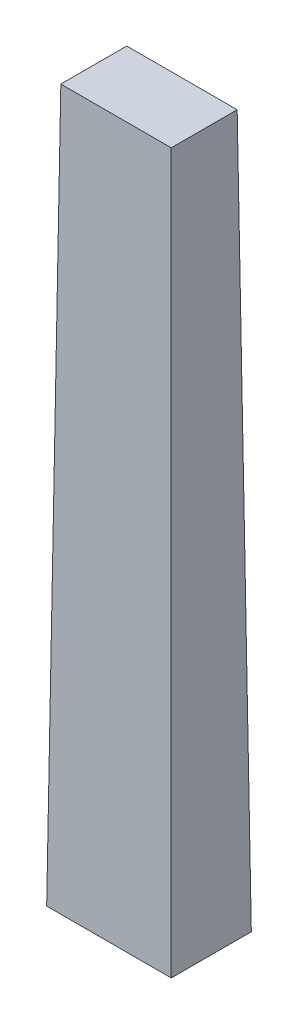
ISO-10303-21;
HEADER;
FILE_DESCRIPTION(('STEP AP214'),'2;1');
FILE_NAME('part.step','',(''),(''),'','','');
FILE_SCHEMA(('AUTOMOTIVE_DESIGN { 1 0 10303 214 1 1 1 1 }'));
ENDSEC;
DATA;
#1=APPLICATION_CONTEXT('core data for automotive mechanical design processes');
#2=APPLICATION_PROTOCOL_DEFINITION('international standard','automotive_design',2000,#1);
#3=PRODUCT_CONTEXT('',#1,'mechanical');
#4=PRODUCT('Part','Part','',(#3));
#5=PRODUCT_RELATED_PRODUCT_CATEGORY('part','',(#4));
#6=PRODUCT_DEFINITION_FORMATION('','',#4);
#7=PRODUCT_DEFINITION_CONTEXT('part definition',#1,'design');
#8=PRODUCT_DEFINITION('design','',#6,#7);
#9=PRODUCT_DEFINITION_SHAPE('','',#8);
#10=(LENGTH_UNIT() NAMED_UNIT(*) SI_UNIT(.MILLI.,.METRE.));
#11=(NAMED_UNIT(*) PLANE_ANGLE_UNIT() SI_UNIT($,.RADIAN.));
#12=(NAMED_UNIT(*) SI_UNIT($,.STERADIAN.) SOLID_ANGLE_UNIT());
#13=UNCERTAINTY_MEASURE_WITH_UNIT(LENGTH_MEASURE(1.E-05),#10,'distance_accuracy_value','');
#14=(GEOMETRIC_REPRESENTATION_CONTEXT(3) GLOBAL_UNCERTAINTY_ASSIGNED_CONTEXT((#13)) GLOBAL_UNIT_ASSIGNED_CONTEXT((#10,
#11,#12)) REPRESENTATION_CONTEXT('',''));
#15=CARTESIAN_POINT('',(0.,0.,0.));
#16=DIRECTION('',(0.,0.,1.));
#17=DIRECTION('',(1.,0.,0.));
#18=AXIS2_PLACEMENT_3D('',#15,#16,#17);
#19=CARTESIAN_POINT('',(-8.096049858686,0.,-9.18392244204399));
#20=DIRECTION('',(-0.999950515308283,0.00994821263837438,0.));
#21=DIRECTION('',(-0.00994821263837438,-0.999950515308283,0.));
#22=AXIS2_PLACEMENT_3D('',#19,#20,#21);
#23=PLANE('',#22);
#24=DIRECTION('',(0.,0.,1.));
#25=VECTOR('',#24,1.);
#26=CARTESIAN_POINT('',(-8.096049858686,0.,-9.18392244204399));
#27=LINE('',#26,#25);
#28=CARTESIAN_POINT('',(-8.096049858686,0.,-9.18392244204399));
#29=VERTEX_POINT('',#28);
#30=CARTESIAN_POINT('',(-8.096049858686,0.,-0.183922442043995));
#31=VERTEX_POINT('',#30);
#32=EDGE_CURVE('E83',#29,#31,#27,.T.);
#33=ORIENTED_EDGE('',*,*,#32,.T.);
#34=DIRECTION('',(-0.00994772040285509,-0.999901037962044,0.00994772040285509));
#35=VECTOR('',#34,1.);
#36=CARTESIAN_POINT('',(-8.096049858686,0.,-0.183922442043995));
#37=LINE('',#36,#35);
#38=CARTESIAN_POINT('',(-7.30015346292827,80.,-0.979818837801727));
#39=VERTEX_POINT('',#38);
#40=EDGE_CURVE('E11',#39,#31,#37,.T.);
#41=ORIENTED_EDGE('',*,*,#40,.F.);
#42=DIRECTION('',(0.,0.,-1.));
#43=VECTOR('',#42,1.);
#44=CARTESIAN_POINT('',(-7.30015346292827,80.,-9.18392244204399));
#45=LINE('',#44,#43);
#46=CARTESIAN_POINT('',(-7.30015346292827,80.,-8.38802604628626));
#47=VERTEX_POINT('',#46);
#48=EDGE_CURVE('E99',#47,#39,#45,.F.);
#49=ORIENTED_EDGE('',*,*,#48,.F.);
#50=DIRECTION('',(-0.00994772040285508,-0.999901037962044,-0.00994772040285509));
#51=VECTOR('',#50,1.);
#52=CARTESIAN_POINT('',(-8.096049858686,0.,-9.18392244204399));
#53=LINE('',#52,#51);
#54=EDGE_CURVE('E94',#47,#29,#53,.T.);
#55=ORIENTED_EDGE('',*,*,#54,.T.);
#56=EDGE_LOOP('',(#33,#41,#49,#55));
#57=FACE_BOUND('',#56,.T.);
#58=ADVANCED_FACE('F37',(#57),#23,.T.);
#59=CARTESIAN_POINT('',(-8.096049858686,0.,-0.183922442043995));
#60=DIRECTION('',(0.,0.00994821263837438,0.999950515308283));
#61=DIRECTION('',(0.,-0.999950515308283,0.00994821263837438));
#62=AXIS2_PLACEMENT_3D('',#59,#60,#61);
#63=PLANE('',#62);
#64=DIRECTION('',(1.,0.,0.));
#65=VECTOR('',#64,1.);
#66=CARTESIAN_POINT('',(-8.096049858686,0.,-0.183922442043995));
#67=LINE('',#66,#65);
#68=CARTESIAN_POINT('',(5.903950141314,0.,-0.183922442043995));
#69=VERTEX_POINT('',#68);
#70=EDGE_CURVE('E79',#31,#69,#67,.T.);
#71=ORIENTED_EDGE('',*,*,#70,.T.);
#72=DIRECTION('',(0.00994772040285509,-0.999901037962044,0.00994772040285509));
#73=VECTOR('',#72,1.);
#74=CARTESIAN_POINT('',(5.90305952704308,0.089520623605539,-0.184813056314915));
#75=LINE('',#74,#73);
#76=CARTESIAN_POINT('',(5.10805374555626,80.,-0.979818837801727));
#77=VERTEX_POINT('',#76);
#78=EDGE_CURVE('E46',#77,#69,#75,.T.);
#79=ORIENTED_EDGE('',*,*,#78,.F.);
#80=DIRECTION('',(-1.,0.,0.));
#81=VECTOR('',#80,1.);
#82=CARTESIAN_POINT('',(-8.096049858686,80.,-0.979818837801727));
#83=LINE('',#82,#81);
#84=EDGE_CURVE('E90',#39,#77,#83,.F.);
#85=ORIENTED_EDGE('',*,*,#84,.F.);
#86=ORIENTED_EDGE('',*,*,#40,.T.);
#87=EDGE_LOOP('',(#71,#79,#85,#86));
#88=FACE_BOUND('',#87,.T.);
#89=ADVANCED_FACE('F39',(#88),#63,.T.);
#90=CARTESIAN_POINT('',(5.903950141314,0.,-9.18392244204399));
#91=DIRECTION('',(0.999950515308283,0.00994821263837438,0.));
#92=DIRECTION('',(-0.00994821263837438,0.999950515308283,0.));
#93=AXIS2_PLACEMENT_3D('',#90,#91,#92);
#94=PLANE('',#93);
#95=DIRECTION('',(0.,0.,-1.));
#96=VECTOR('',#95,1.);
#97=CARTESIAN_POINT('',(5.903950141314,0.,-9.18392244204399));
#98=LINE('',#97,#96);
#99=CARTESIAN_POINT('',(5.903950141314,0.,-9.18392244204399));
#100=VERTEX_POINT('',#99);
#101=EDGE_CURVE('E84',#69,#100,#98,.T.);
#102=ORIENTED_EDGE('',*,*,#101,.T.);
#103=DIRECTION('',(0.00994772040285508,-0.999901037962044,-0.00994772040285509));
#104=VECTOR('',#103,1.);
#105=CARTESIAN_POINT('',(5.90256474133701,0.139254303386394,-9.18253704206701));
#106=LINE('',#105,#104);
#107=CARTESIAN_POINT('',(5.10805374555626,80.,-8.38802604628626));
#108=VERTEX_POINT('',#107);
#109=EDGE_CURVE('E102',#108,#100,#106,.T.);
#110=ORIENTED_EDGE('',*,*,#109,.F.);
#111=DIRECTION('',(0.,0.,1.));
#112=VECTOR('',#111,1.);
#113=CARTESIAN_POINT('',(5.10805374555626,80.,-9.18392244204399));
#114=LINE('',#113,#112);
#115=EDGE_CURVE('E58',#77,#108,#114,.F.);
#116=ORIENTED_EDGE('',*,*,#115,.F.);
#117=ORIENTED_EDGE('',*,*,#78,.T.);
#118=EDGE_LOOP('',(#102,#110,#116,#117));
#119=FACE_BOUND('',#118,.T.);
#120=ADVANCED_FACE('F109',(#119),#94,.T.);
#121=CARTESIAN_POINT('',(-8.096049858686,0.,-9.18392244204399));
#122=DIRECTION('',(0.,0.00994821263837438,-0.999950515308283));
#123=DIRECTION('',(0.,0.999950515308284,0.00994821263837438));
#124=AXIS2_PLACEMENT_3D('',#121,#122,#123);
#125=PLANE('',#124);
#126=DIRECTION('',(-1.,0.,0.));
#127=VECTOR('',#126,1.);
#128=CARTESIAN_POINT('',(-8.096049858686,0.,-9.18392244204399));
#129=LINE('',#128,#127);
#130=EDGE_CURVE('E98',#100,#29,#129,.T.);
#131=ORIENTED_EDGE('',*,*,#130,.T.);
#132=ORIENTED_EDGE('',*,*,#54,.F.);
#133=DIRECTION('',(1.,0.,0.));
#134=VECTOR('',#133,1.);
#135=CARTESIAN_POINT('',(-8.096049858686,80.,-8.38802604628626));
#136=LINE('',#135,#134);
#137=EDGE_CURVE('E41',#108,#47,#136,.F.);
#138=ORIENTED_EDGE('',*,*,#137,.F.);
#139=ORIENTED_EDGE('',*,*,#109,.T.);
#140=EDGE_LOOP('',(#131,#132,#138,#139));
#141=FACE_BOUND('',#140,.T.);
#142=ADVANCED_FACE('F111',(#141),#125,.T.);
#143=CARTESIAN_POINT('',(0.,80.,0.));
#144=DIRECTION('',(0.,1.,0.));
#145=DIRECTION('',(0.,0.,1.));
#146=AXIS2_PLACEMENT_3D('',#143,#144,#145);
#147=PLANE('',#146);
#148=ORIENTED_EDGE('',*,*,#48,.T.);
#149=ORIENTED_EDGE('',*,*,#84,.T.);
#150=ORIENTED_EDGE('',*,*,#115,.T.);
#151=ORIENTED_EDGE('',*,*,#137,.T.);
#152=EDGE_LOOP('',(#148,#149,#150,#151));
#153=FACE_BOUND('',#152,.T.);
#154=ADVANCED_FACE('F107',(#153),#147,.T.);
#155=CARTESIAN_POINT('',(0.,0.,0.));
#156=DIRECTION('',(0.,1.,0.));
#157=DIRECTION('',(0.,0.,1.));
#158=AXIS2_PLACEMENT_3D('',#155,#156,#157);
#159=PLANE('',#158);
#160=ORIENTED_EDGE('',*,*,#32,.F.);
#161=ORIENTED_EDGE('',*,*,#130,.F.);
#162=ORIENTED_EDGE('',*,*,#101,.F.);
#163=ORIENTED_EDGE('',*,*,#70,.F.);
#164=EDGE_LOOP('',(#160,#161,#162,#163));
#165=FACE_BOUND('',#164,.T.);
#166=ADVANCED_FACE('F80',(#165),#159,.F.);
#167=CLOSED_SHELL('',(#58,#89,#120,#142,#154,#166));
#168=MANIFOLD_SOLID_BREP('B2',#167);
#169=ADVANCED_BREP_SHAPE_REPRESENTATION('',(#18,#168),#14);
#170=SHAPE_DEFINITION_REPRESENTATION(#9,#169);
ENDSEC;
END-ISO-10303-21;
